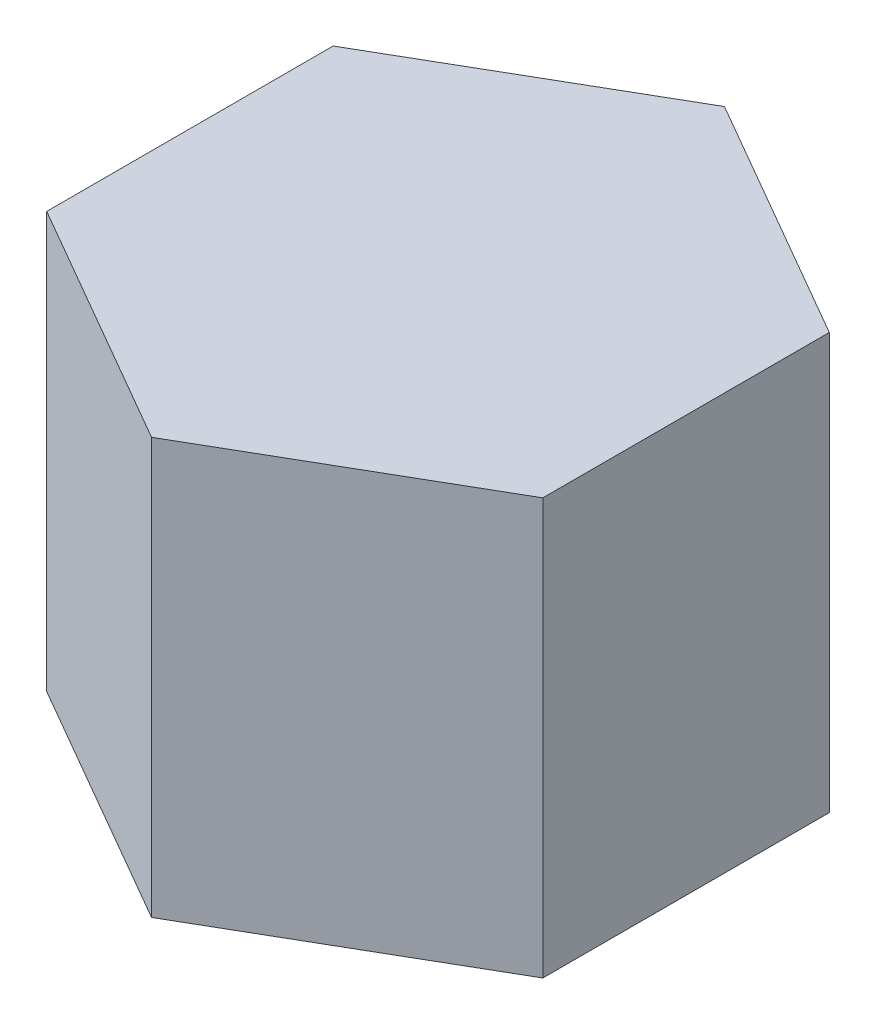
ISO-10303-21;
HEADER;
FILE_DESCRIPTION(('STEP AP214'),'2;1');
FILE_NAME('part.step','',(''),(''),'','','');
FILE_SCHEMA(('AUTOMOTIVE_DESIGN { 1 0 10303 214 1 1 1 1 }'));
ENDSEC;
DATA;
#1=APPLICATION_CONTEXT('core data for automotive mechanical design processes');
#2=APPLICATION_PROTOCOL_DEFINITION('international standard','automotive_design',2000,#1);
#3=PRODUCT_CONTEXT('',#1,'mechanical');
#4=PRODUCT('Part','Part','',(#3));
#5=PRODUCT_RELATED_PRODUCT_CATEGORY('part','',(#4));
#6=PRODUCT_DEFINITION_FORMATION('','',#4);
#7=PRODUCT_DEFINITION_CONTEXT('part definition',#1,'design');
#8=PRODUCT_DEFINITION('design','',#6,#7);
#9=PRODUCT_DEFINITION_SHAPE('','',#8);
#10=(LENGTH_UNIT() NAMED_UNIT(*) SI_UNIT(.MILLI.,.METRE.));
#11=(NAMED_UNIT(*) PLANE_ANGLE_UNIT() SI_UNIT($,.RADIAN.));
#12=(NAMED_UNIT(*) SI_UNIT($,.STERADIAN.) SOLID_ANGLE_UNIT());
#13=UNCERTAINTY_MEASURE_WITH_UNIT(LENGTH_MEASURE(1.E-05),#10,'distance_accuracy_value','');
#14=(GEOMETRIC_REPRESENTATION_CONTEXT(3) GLOBAL_UNCERTAINTY_ASSIGNED_CONTEXT((#13)) GLOBAL_UNIT_ASSIGNED_CONTEXT((#10,
#11,#12)) REPRESENTATION_CONTEXT('',''));
#15=CARTESIAN_POINT('',(0.,0.,0.));
#16=DIRECTION('',(0.,0.,1.));
#17=DIRECTION('',(1.,0.,0.));
#18=AXIS2_PLACEMENT_3D('',#15,#16,#17);
#19=CARTESIAN_POINT('',(204.142660308706,-148.537700895744,294.105047431848));
#20=DIRECTION('',(-0.499999999999943,0.,-0.866025403784472));
#21=DIRECTION('',(-0.866025403784472,0.,0.499999999999943));
#22=AXIS2_PLACEMENT_3D('',#19,#20,#21);
#23=PLANE('',#22);
#24=CARTESIAN_POINT('',(203.839551417381,-149.045793579175,294.280047431848));
#25=DIRECTION('',(0.866025403784471,0.,-0.499999999999943));
#26=VECTOR('',#25,1.);
#27=LINE('',#24,#26);
#28=CARTESIAN_POINT('',(203.839551417382,-149.045793579175,294.280047431848));
#29=VERTEX_POINT('',#28);
#30=CARTESIAN_POINT('',(204.142660308706,-149.045793579175,294.105047431848));
#31=VERTEX_POINT('',#30);
#32=EDGE_CURVE('E170',#29,#31,#27,.T.);
#33=ORIENTED_EDGE('',*,*,#32,.T.);
#34=CARTESIAN_POINT('',(204.142660308706,-148.537700895744,294.105047431848));
#35=DIRECTION('',(0.,-1.,0.));
#36=VECTOR('',#35,1.);
#37=LINE('',#34,#36);
#38=CARTESIAN_POINT('',(204.142660308706,-148.537700895744,294.105047431848));
#39=VERTEX_POINT('',#38);
#40=EDGE_CURVE('E35',#39,#31,#37,.T.);
#41=ORIENTED_EDGE('',*,*,#40,.F.);
#42=CARTESIAN_POINT('',(203.839551417381,-148.537700895744,294.280047431848));
#43=DIRECTION('',(0.866025403784471,0.,-0.499999999999943));
#44=VECTOR('',#43,1.);
#45=LINE('',#42,#44);
#46=CARTESIAN_POINT('',(203.839551417382,-148.537700895744,294.280047431848));
#47=VERTEX_POINT('',#46);
#48=EDGE_CURVE('E159',#47,#39,#45,.T.);
#49=ORIENTED_EDGE('',*,*,#48,.F.);
#50=CARTESIAN_POINT('',(203.839551417381,-148.537700895744,294.280047431848));
#51=DIRECTION('',(0.,-1.,0.));
#52=VECTOR('',#51,1.);
#53=LINE('',#50,#52);
#54=EDGE_CURVE('E10',#47,#29,#53,.T.);
#55=ORIENTED_EDGE('',*,*,#54,.T.);
#56=EDGE_LOOP('',(#33,#41,#49,#55));
#57=FACE_BOUND('',#56,.T.);
#58=ADVANCED_FACE('F16',(#57),#23,.F.);
#59=CARTESIAN_POINT('',(203.839551417382,-148.537700895744,294.280047431848));
#60=DIRECTION('',(0.499999999999978,0.,-0.866025403784452));
#61=DIRECTION('',(-0.866025403784452,0.,-0.499999999999978));
#62=AXIS2_PLACEMENT_3D('',#59,#60,#61);
#63=PLANE('',#62);
#64=CARTESIAN_POINT('',(203.536442526057,-149.045793579175,294.105047431848));
#65=DIRECTION('',(0.866025403784452,0.,0.499999999999978));
#66=VECTOR('',#65,1.);
#67=LINE('',#64,#66);
#68=CARTESIAN_POINT('',(203.536442526057,-149.045793579175,294.105047431848));
#69=VERTEX_POINT('',#68);
#70=EDGE_CURVE('E167',#69,#29,#67,.T.);
#71=ORIENTED_EDGE('',*,*,#70,.T.);
#72=ORIENTED_EDGE('',*,*,#54,.F.);
#73=CARTESIAN_POINT('',(203.536442526057,-148.537700895744,294.105047431848));
#74=DIRECTION('',(0.866025403784452,0.,0.499999999999978));
#75=VECTOR('',#74,1.);
#76=LINE('',#73,#75);
#77=CARTESIAN_POINT('',(203.536442526057,-148.537700895744,294.105047431848));
#78=VERTEX_POINT('',#77);
#79=EDGE_CURVE('E156',#78,#47,#76,.T.);
#80=ORIENTED_EDGE('',*,*,#79,.F.);
#81=CARTESIAN_POINT('',(203.536442526057,-148.537700895744,294.105047431848));
#82=DIRECTION('',(0.,-1.,0.));
#83=VECTOR('',#82,1.);
#84=LINE('',#81,#83);
#85=EDGE_CURVE('E27',#78,#69,#84,.T.);
#86=ORIENTED_EDGE('',*,*,#85,.T.);
#87=EDGE_LOOP('',(#71,#72,#80,#86));
#88=FACE_BOUND('',#87,.T.);
#89=ADVANCED_FACE('F189',(#88),#63,.F.);
#90=CARTESIAN_POINT('',(203.536442526057,-148.537700895744,290.831971220494));
#91=DIRECTION('',(1.,0.,0.));
#92=DIRECTION('',(0.,1.,0.));
#93=AXIS2_PLACEMENT_3D('',#90,#91,#92);
#94=PLANE('',#93);
#95=CARTESIAN_POINT('',(203.536442526057,-149.045793579175,293.755047431848));
#96=DIRECTION('',(0.,0.,1.));
#97=VECTOR('',#96,1.);
#98=LINE('',#95,#97);
#99=CARTESIAN_POINT('',(203.536442526057,-149.045793579175,293.755047431848));
#100=VERTEX_POINT('',#99);
#101=EDGE_CURVE('E163',#100,#69,#98,.T.);
#102=ORIENTED_EDGE('',*,*,#101,.T.);
#103=ORIENTED_EDGE('',*,*,#85,.F.);
#104=CARTESIAN_POINT('',(203.536442526057,-148.537700895744,293.755047431848));
#105=DIRECTION('',(0.,0.,1.));
#106=VECTOR('',#105,1.);
#107=LINE('',#104,#106);
#108=CARTESIAN_POINT('',(203.536442526057,-148.537700895744,293.755047431848));
#109=VERTEX_POINT('',#108);
#110=EDGE_CURVE('E106',#109,#78,#107,.T.);
#111=ORIENTED_EDGE('',*,*,#110,.F.);
#112=CARTESIAN_POINT('',(203.536442526057,-148.537700895744,293.755047431848));
#113=DIRECTION('',(0.,-1.,0.));
#114=VECTOR('',#113,1.);
#115=LINE('',#112,#114);
#116=EDGE_CURVE('E94',#109,#100,#115,.T.);
#117=ORIENTED_EDGE('',*,*,#116,.T.);
#118=EDGE_LOOP('',(#102,#103,#111,#117));
#119=FACE_BOUND('',#118,.T.);
#120=ADVANCED_FACE('F198',(#119),#94,.F.);
#121=CARTESIAN_POINT('',(203.536442526057,-148.537700895744,293.755047431848));
#122=DIRECTION('',(0.499999999999978,0.,0.866025403784452));
#123=DIRECTION('',(0.866025403784452,0.,-0.499999999999978));
#124=AXIS2_PLACEMENT_3D('',#121,#122,#123);
#125=PLANE('',#124);
#126=CARTESIAN_POINT('',(203.839551417382,-149.045793579175,293.580047431848));
#127=DIRECTION('',(-0.866025403784452,0.,0.499999999999978));
#128=VECTOR('',#127,1.);
#129=LINE('',#126,#128);
#130=CARTESIAN_POINT('',(203.839551417382,-149.045793579175,293.580047431848));
#131=VERTEX_POINT('',#130);
#132=EDGE_CURVE('E162',#131,#100,#129,.T.);
#133=ORIENTED_EDGE('',*,*,#132,.T.);
#134=ORIENTED_EDGE('',*,*,#116,.F.);
#135=CARTESIAN_POINT('',(203.839551417382,-148.537700895744,293.580047431848));
#136=DIRECTION('',(-0.866025403784452,0.,0.499999999999978));
#137=VECTOR('',#136,1.);
#138=LINE('',#135,#137);
#139=CARTESIAN_POINT('',(203.839551417382,-148.537700895744,293.580047431848));
#140=VERTEX_POINT('',#139);
#141=EDGE_CURVE('E98',#140,#109,#138,.T.);
#142=ORIENTED_EDGE('',*,*,#141,.F.);
#143=CARTESIAN_POINT('',(203.839551417382,-148.537700895744,293.580047431848));
#144=DIRECTION('',(0.,-1.,0.));
#145=VECTOR('',#144,1.);
#146=LINE('',#143,#145);
#147=EDGE_CURVE('E79',#140,#131,#146,.T.);
#148=ORIENTED_EDGE('',*,*,#147,.T.);
#149=EDGE_LOOP('',(#133,#134,#142,#148));
#150=FACE_BOUND('',#149,.T.);
#151=ADVANCED_FACE('F100',(#150),#125,.F.);
#152=CARTESIAN_POINT('',(203.839551417382,-148.537700895744,293.580047431848));
#153=DIRECTION('',(-0.500000000000096,0.,0.866025403784383));
#154=DIRECTION('',(0.866025403784383,0.,0.500000000000096));
#155=AXIS2_PLACEMENT_3D('',#152,#153,#154);
#156=PLANE('',#155);
#157=CARTESIAN_POINT('',(204.142660308706,-149.045793579175,293.755047431848));
#158=DIRECTION('',(-0.866025403784383,0.,-0.500000000000096));
#159=VECTOR('',#158,1.);
#160=LINE('',#157,#159);
#161=CARTESIAN_POINT('',(204.142660308706,-149.045793579175,293.755047431848));
#162=VERTEX_POINT('',#161);
#163=EDGE_CURVE('E88',#162,#131,#160,.T.);
#164=ORIENTED_EDGE('',*,*,#163,.T.);
#165=ORIENTED_EDGE('',*,*,#147,.F.);
#166=CARTESIAN_POINT('',(204.142660308706,-148.537700895744,293.755047431848));
#167=DIRECTION('',(-0.866025403784383,0.,-0.500000000000096));
#168=VECTOR('',#167,1.);
#169=LINE('',#166,#168);
#170=CARTESIAN_POINT('',(204.142660308706,-148.537700895744,293.755047431848));
#171=VERTEX_POINT('',#170);
#172=EDGE_CURVE('E84',#171,#140,#169,.T.);
#173=ORIENTED_EDGE('',*,*,#172,.F.);
#174=CARTESIAN_POINT('',(204.142660308706,-148.537700895744,293.755047431848));
#175=DIRECTION('',(0.,-1.,0.));
#176=VECTOR('',#175,1.);
#177=LINE('',#174,#176);
#178=EDGE_CURVE('E58',#171,#162,#177,.T.);
#179=ORIENTED_EDGE('',*,*,#178,.T.);
#180=EDGE_LOOP('',(#164,#165,#173,#179));
#181=FACE_BOUND('',#180,.T.);
#182=ADVANCED_FACE('F82',(#181),#156,.F.);
#183=CARTESIAN_POINT('',(204.142660308706,-148.537700895744,290.831971220494));
#184=DIRECTION('',(-1.,0.,0.));
#185=DIRECTION('',(0.,-1.,0.));
#186=AXIS2_PLACEMENT_3D('',#183,#184,#185);
#187=PLANE('',#186);
#188=CARTESIAN_POINT('',(204.142660308706,-149.045793579175,294.105047431848));
#189=DIRECTION('',(0.,0.,-1.));
#190=VECTOR('',#189,1.);
#191=LINE('',#188,#190);
#192=EDGE_CURVE('E160',#31,#162,#191,.T.);
#193=ORIENTED_EDGE('',*,*,#192,.T.);
#194=ORIENTED_EDGE('',*,*,#178,.F.);
#195=CARTESIAN_POINT('',(204.142660308706,-148.537700895744,294.105047431848));
#196=DIRECTION('',(0.,0.,-1.));
#197=VECTOR('',#196,1.);
#198=LINE('',#195,#197);
#199=EDGE_CURVE('E112',#39,#171,#198,.T.);
#200=ORIENTED_EDGE('',*,*,#199,.F.);
#201=ORIENTED_EDGE('',*,*,#40,.T.);
#202=EDGE_LOOP('',(#193,#194,#200,#201));
#203=FACE_BOUND('',#202,.T.);
#204=ADVANCED_FACE('F131',(#203),#187,.F.);
#205=CARTESIAN_POINT('',(206.339551417382,-148.537700895744,290.831971220494));
#206=DIRECTION('',(0.,-1.,0.));
#207=DIRECTION('',(1.,0.,0.));
#208=AXIS2_PLACEMENT_3D('',#205,#206,#207);
#209=PLANE('',#208);
#210=ORIENTED_EDGE('',*,*,#48,.T.);
#211=ORIENTED_EDGE('',*,*,#199,.T.);
#212=ORIENTED_EDGE('',*,*,#172,.T.);
#213=ORIENTED_EDGE('',*,*,#141,.T.);
#214=ORIENTED_EDGE('',*,*,#110,.T.);
#215=ORIENTED_EDGE('',*,*,#79,.T.);
#216=EDGE_LOOP('',(#210,#211,#212,#213,#214,#215));
#217=FACE_BOUND('',#216,.T.);
#218=ADVANCED_FACE('F111',(#217),#209,.F.);
#219=CARTESIAN_POINT('',(206.339551417382,-149.045793579175,290.831971220494));
#220=DIRECTION('',(0.,-1.,0.));
#221=DIRECTION('',(1.,0.,0.));
#222=AXIS2_PLACEMENT_3D('',#219,#220,#221);
#223=PLANE('',#222);
#224=ORIENTED_EDGE('',*,*,#32,.F.);
#225=ORIENTED_EDGE('',*,*,#70,.F.);
#226=ORIENTED_EDGE('',*,*,#101,.F.);
#227=ORIENTED_EDGE('',*,*,#132,.F.);
#228=ORIENTED_EDGE('',*,*,#163,.F.);
#229=ORIENTED_EDGE('',*,*,#192,.F.);
#230=EDGE_LOOP('',(#224,#225,#226,#227,#228,#229));
#231=FACE_BOUND('',#230,.T.);
#232=ADVANCED_FACE('F130',(#231),#223,.T.);
#233=CLOSED_SHELL('',(#58,#89,#120,#151,#182,#204,#218,#232));
#234=MANIFOLD_SOLID_BREP('B1',#233);
#235=ADVANCED_BREP_SHAPE_REPRESENTATION('',(#18,#234),#14);
#236=SHAPE_DEFINITION_REPRESENTATION(#9,#235);
ENDSEC;
END-ISO-10303-21;
